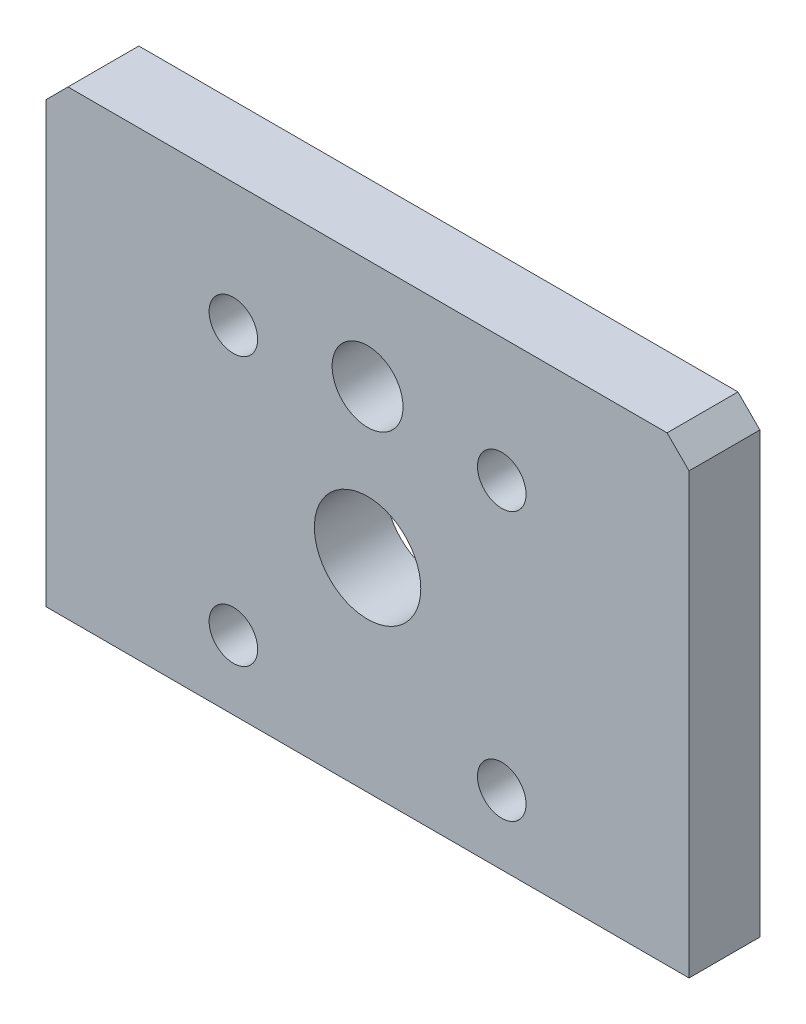
ISO-10303-21;
HEADER;
FILE_DESCRIPTION(('STEP AP214'),'2;1');
FILE_NAME('part.step','',(''),(''),'','','');
FILE_SCHEMA(('AUTOMOTIVE_DESIGN { 1 0 10303 214 1 1 1 1 }'));
ENDSEC;
DATA;
#1=APPLICATION_CONTEXT('core data for automotive mechanical design processes');
#2=APPLICATION_PROTOCOL_DEFINITION('international standard','automotive_design',2000,#1);
#3=PRODUCT_CONTEXT('',#1,'mechanical');
#4=PRODUCT('Part','Part','',(#3));
#5=PRODUCT_RELATED_PRODUCT_CATEGORY('part','',(#4));
#6=PRODUCT_DEFINITION_FORMATION('','',#4);
#7=PRODUCT_DEFINITION_CONTEXT('part definition',#1,'design');
#8=PRODUCT_DEFINITION('design','',#6,#7);
#9=PRODUCT_DEFINITION_SHAPE('','',#8);
#10=(LENGTH_UNIT() NAMED_UNIT(*) SI_UNIT(.MILLI.,.METRE.));
#11=(NAMED_UNIT(*) PLANE_ANGLE_UNIT() SI_UNIT($,.RADIAN.));
#12=(NAMED_UNIT(*) SI_UNIT($,.STERADIAN.) SOLID_ANGLE_UNIT());
#13=UNCERTAINTY_MEASURE_WITH_UNIT(LENGTH_MEASURE(1.E-05),#10,'distance_accuracy_value','');
#14=(GEOMETRIC_REPRESENTATION_CONTEXT(3) GLOBAL_UNCERTAINTY_ASSIGNED_CONTEXT((#13)) GLOBAL_UNIT_ASSIGNED_CONTEXT((#10,
#11,#12)) REPRESENTATION_CONTEXT('',''));
#15=CARTESIAN_POINT('',(0.,0.,0.));
#16=DIRECTION('',(0.,0.,1.));
#17=DIRECTION('',(1.,0.,0.));
#18=AXIS2_PLACEMENT_3D('',#15,#16,#17);
#19=CARTESIAN_POINT('',(30.2260023359817,18.0340010436572,1.016));
#20=DIRECTION('',(0.,0.,1.));
#21=DIRECTION('',(1.,0.,0.));
#22=AXIS2_PLACEMENT_3D('',#19,#20,#21);
#23=PLANE('',#22);
#24=CARTESIAN_POINT('',(30.2260023359817,18.0340010436572,1.016));
#25=DIRECTION('',(0.,0.,1.));
#26=DIRECTION('',(1.,0.,0.));
#27=AXIS2_PLACEMENT_3D('',#24,#25,#26);
#28=CIRCLE('',#27,7.1501);
#29=CARTESIAN_POINT('',(37.3761023359817,18.0340010436572,1.016));
#30=VERTEX_POINT('',#29);
#31=EDGE_CURVE('E19',#30,#30,#28,.F.);
#32=ORIENTED_EDGE('',*,*,#31,.T.);
#33=EDGE_LOOP('',(#32));
#34=FACE_BOUND('',#33,.T.);
#35=ADVANCED_FACE('F16',(#34),#23,.F.);
#36=CARTESIAN_POINT('',(30.2260023359815,-18.0340010436569,1.016));
#37=DIRECTION('',(0.,0.,1.));
#38=DIRECTION('',(1.,0.,0.));
#39=AXIS2_PLACEMENT_3D('',#36,#37,#38);
#40=PLANE('',#39);
#41=CARTESIAN_POINT('',(30.2260023359815,-18.0340010436569,1.016));
#42=DIRECTION('',(0.,0.,1.));
#43=DIRECTION('',(1.,0.,0.));
#44=AXIS2_PLACEMENT_3D('',#41,#42,#43);
#45=CIRCLE('',#44,7.1501);
#46=CARTESIAN_POINT('',(37.3761023359815,-18.0340010436569,1.016));
#47=VERTEX_POINT('',#46);
#48=EDGE_CURVE('E146',#47,#47,#45,.F.);
#49=ORIENTED_EDGE('',*,*,#48,.T.);
#50=EDGE_LOOP('',(#49));
#51=FACE_BOUND('',#50,.T.);
#52=ADVANCED_FACE('F238',(#51),#40,.F.);
#53=CARTESIAN_POINT('',(-30.2260023359812,18.0340010436578,1.016));
#54=DIRECTION('',(0.,0.,1.));
#55=DIRECTION('',(1.,0.,0.));
#56=AXIS2_PLACEMENT_3D('',#53,#54,#55);
#57=PLANE('',#56);
#58=CARTESIAN_POINT('',(-30.2260023359812,18.0340010436578,1.016));
#59=DIRECTION('',(0.,0.,1.));
#60=DIRECTION('',(1.,0.,0.));
#61=AXIS2_PLACEMENT_3D('',#58,#59,#60);
#62=CIRCLE('',#61,7.1501);
#63=CARTESIAN_POINT('',(-23.0759023359812,18.0340010436578,1.016));
#64=VERTEX_POINT('',#63);
#65=EDGE_CURVE('E144',#64,#64,#62,.F.);
#66=ORIENTED_EDGE('',*,*,#65,.T.);
#67=EDGE_LOOP('',(#66));
#68=FACE_BOUND('',#67,.T.);
#69=ADVANCED_FACE('F168',(#68),#57,.F.);
#70=CARTESIAN_POINT('',(-30.2260023359813,-18.0340010436572,1.016));
#71=DIRECTION('',(0.,0.,1.));
#72=DIRECTION('',(1.,0.,0.));
#73=AXIS2_PLACEMENT_3D('',#70,#71,#72);
#74=PLANE('',#73);
#75=CARTESIAN_POINT('',(-30.2260023359813,-18.0340010436572,1.016));
#76=DIRECTION('',(0.,0.,1.));
#77=DIRECTION('',(1.,0.,0.));
#78=AXIS2_PLACEMENT_3D('',#75,#76,#77);
#79=CIRCLE('',#78,7.1501);
#80=CARTESIAN_POINT('',(-23.0759023359813,-18.0340010436572,1.016));
#81=VERTEX_POINT('',#80);
#82=EDGE_CURVE('E141',#81,#81,#79,.F.);
#83=ORIENTED_EDGE('',*,*,#82,.T.);
#84=EDGE_LOOP('',(#83));
#85=FACE_BOUND('',#84,.T.);
#86=ADVANCED_FACE('F157',(#85),#74,.F.);
#87=CARTESIAN_POINT('',(30.2260023359817,18.0340010436572,0.));
#88=DIRECTION('',(0.,0.,1.));
#89=DIRECTION('',(1.,0.,0.));
#90=AXIS2_PLACEMENT_3D('',#87,#88,#89);
#91=CYLINDRICAL_SURFACE('',#90,7.1501);
#92=CARTESIAN_POINT('',(30.2260023359817,18.0340010436572,0.));
#93=DIRECTION('',(0.,0.,1.));
#94=DIRECTION('',(1.,0.,0.));
#95=AXIS2_PLACEMENT_3D('',#92,#93,#94);
#96=CIRCLE('',#95,7.1501);
#97=CARTESIAN_POINT('',(37.3761023359817,18.0340010436572,0.));
#98=VERTEX_POINT('',#97);
#99=EDGE_CURVE('E138',#98,#98,#96,.F.);
#100=ORIENTED_EDGE('',*,*,#99,.T.);
#101=EDGE_LOOP('',(#100));
#102=FACE_BOUND('',#101,.T.);
#103=ORIENTED_EDGE('',*,*,#31,.F.);
#104=EDGE_LOOP('',(#103));
#105=FACE_BOUND('',#104,.T.);
#106=ADVANCED_FACE('F154',(#102,#105),#91,.F.);
#107=CARTESIAN_POINT('',(30.2260023359815,-18.0340010436569,0.));
#108=DIRECTION('',(0.,0.,1.));
#109=DIRECTION('',(1.,0.,0.));
#110=AXIS2_PLACEMENT_3D('',#107,#108,#109);
#111=CYLINDRICAL_SURFACE('',#110,7.1501);
#112=CARTESIAN_POINT('',(30.2260023359815,-18.0340010436569,0.));
#113=DIRECTION('',(0.,0.,1.));
#114=DIRECTION('',(1.,0.,0.));
#115=AXIS2_PLACEMENT_3D('',#112,#113,#114);
#116=CIRCLE('',#115,7.1501);
#117=CARTESIAN_POINT('',(37.3761023359815,-18.0340010436569,0.));
#118=VERTEX_POINT('',#117);
#119=EDGE_CURVE('E135',#118,#118,#116,.F.);
#120=ORIENTED_EDGE('',*,*,#119,.T.);
#121=EDGE_LOOP('',(#120));
#122=FACE_BOUND('',#121,.T.);
#123=ORIENTED_EDGE('',*,*,#48,.F.);
#124=EDGE_LOOP('',(#123));
#125=FACE_BOUND('',#124,.T.);
#126=ADVANCED_FACE('F156',(#122,#125),#111,.F.);
#127=CARTESIAN_POINT('',(-30.2260023359812,18.0340010436578,0.));
#128=DIRECTION('',(0.,0.,1.));
#129=DIRECTION('',(1.,0.,0.));
#130=AXIS2_PLACEMENT_3D('',#127,#128,#129);
#131=CYLINDRICAL_SURFACE('',#130,7.1501);
#132=CARTESIAN_POINT('',(-30.2260023359812,18.0340010436578,0.));
#133=DIRECTION('',(0.,0.,1.));
#134=DIRECTION('',(1.,0.,0.));
#135=AXIS2_PLACEMENT_3D('',#132,#133,#134);
#136=CIRCLE('',#135,7.1501);
#137=CARTESIAN_POINT('',(-23.0759023359812,18.0340010436578,0.));
#138=VERTEX_POINT('',#137);
#139=EDGE_CURVE('E132',#138,#138,#136,.F.);
#140=ORIENTED_EDGE('',*,*,#139,.T.);
#141=EDGE_LOOP('',(#140));
#142=FACE_BOUND('',#141,.T.);
#143=ORIENTED_EDGE('',*,*,#65,.F.);
#144=EDGE_LOOP('',(#143));
#145=FACE_BOUND('',#144,.T.);
#146=ADVANCED_FACE('F165',(#142,#145),#131,.F.);
#147=CARTESIAN_POINT('',(-30.2260023359813,-18.0340010436572,0.));
#148=DIRECTION('',(0.,0.,1.));
#149=DIRECTION('',(1.,0.,0.));
#150=AXIS2_PLACEMENT_3D('',#147,#148,#149);
#151=CYLINDRICAL_SURFACE('',#150,7.1501);
#152=CARTESIAN_POINT('',(-30.2260023359813,-18.0340010436572,0.));
#153=DIRECTION('',(0.,0.,1.));
#154=DIRECTION('',(1.,0.,0.));
#155=AXIS2_PLACEMENT_3D('',#152,#153,#154);
#156=CIRCLE('',#155,7.1501);
#157=CARTESIAN_POINT('',(-23.0759023359813,-18.0340010436572,0.));
#158=VERTEX_POINT('',#157);
#159=EDGE_CURVE('E129',#158,#158,#156,.F.);
#160=ORIENTED_EDGE('',*,*,#159,.T.);
#161=EDGE_LOOP('',(#160));
#162=FACE_BOUND('',#161,.T.);
#163=ORIENTED_EDGE('',*,*,#82,.F.);
#164=EDGE_LOOP('',(#163));
#165=FACE_BOUND('',#164,.T.);
#166=ADVANCED_FACE('F224',(#162,#165),#151,.F.);
#167=CARTESIAN_POINT('',(-0.000517960062179773,3.30753162764427,0.));
#168=DIRECTION('',(0.,0.,1.));
#169=DIRECTION('',(1.,0.,0.));
#170=AXIS2_PLACEMENT_3D('',#167,#168,#169);
#171=PLANE('',#170);
#172=CARTESIAN_POINT('',(-18.034,18.034,0.));
#173=DIRECTION('',(0.,0.,1.));
#174=DIRECTION('',(1.,0.,0.));
#175=AXIS2_PLACEMENT_3D('',#172,#173,#174);
#176=CIRCLE('',#175,3.2639);
#177=CARTESIAN_POINT('',(-14.7701,18.034,0.));
#178=VERTEX_POINT('',#177);
#179=EDGE_CURVE('E112',#178,#178,#176,.T.);
#180=ORIENTED_EDGE('',*,*,#179,.T.);
#181=EDGE_LOOP('',(#180));
#182=FACE_BOUND('',#181,.T.);
#183=CARTESIAN_POINT('',(18.034,18.034,0.));
#184=DIRECTION('',(0.,0.,1.));
#185=DIRECTION('',(1.,0.,0.));
#186=AXIS2_PLACEMENT_3D('',#183,#184,#185);
#187=CIRCLE('',#186,3.2639);
#188=CARTESIAN_POINT('',(21.2979,18.034,0.));
#189=VERTEX_POINT('',#188);
#190=EDGE_CURVE('E115',#189,#189,#187,.T.);
#191=ORIENTED_EDGE('',*,*,#190,.T.);
#192=EDGE_LOOP('',(#191));
#193=FACE_BOUND('',#192,.T.);
#194=CARTESIAN_POINT('',(-18.034,-18.034,0.));
#195=DIRECTION('',(0.,0.,1.));
#196=DIRECTION('',(1.,0.,0.));
#197=AXIS2_PLACEMENT_3D('',#194,#195,#196);
#198=CIRCLE('',#197,3.2639);
#199=CARTESIAN_POINT('',(-14.7701,-18.034,0.));
#200=VERTEX_POINT('',#199);
#201=EDGE_CURVE('E118',#200,#200,#198,.T.);
#202=ORIENTED_EDGE('',*,*,#201,.T.);
#203=EDGE_LOOP('',(#202));
#204=FACE_BOUND('',#203,.T.);
#205=CARTESIAN_POINT('',(18.0340003967285,-18.0340003967285,0.));
#206=DIRECTION('',(0.,0.,1.));
#207=DIRECTION('',(1.,0.,0.));
#208=AXIS2_PLACEMENT_3D('',#205,#206,#207);
#209=CIRCLE('',#208,3.2639);
#210=CARTESIAN_POINT('',(21.2979003967285,-18.0340003967285,0.));
#211=VERTEX_POINT('',#210);
#212=EDGE_CURVE('E121',#211,#211,#209,.T.);
#213=ORIENTED_EDGE('',*,*,#212,.T.);
#214=EDGE_LOOP('',(#213));
#215=FACE_BOUND('',#214,.T.);
#216=CARTESIAN_POINT('',(0.,0.,0.));
#217=DIRECTION('',(0.,0.,1.));
#218=DIRECTION('',(1.,0.,0.));
#219=AXIS2_PLACEMENT_3D('',#216,#217,#218);
#220=CIRCLE('',#219,7.1501);
#221=CARTESIAN_POINT('',(7.1501,0.,0.));
#222=VERTEX_POINT('',#221);
#223=EDGE_CURVE('E126',#222,#222,#220,.T.);
#224=ORIENTED_EDGE('',*,*,#223,.T.);
#225=EDGE_LOOP('',(#224));
#226=FACE_BOUND('',#225,.T.);
#227=CARTESIAN_POINT('',(0.,19.939,0.));
#228=DIRECTION('',(0.,0.,1.));
#229=DIRECTION('',(1.,0.,0.));
#230=AXIS2_PLACEMENT_3D('',#227,#228,#229);
#231=CIRCLE('',#230,4.7625);
#232=CARTESIAN_POINT('',(4.7625,19.939,0.));
#233=VERTEX_POINT('',#232);
#234=EDGE_CURVE('E80',#233,#233,#231,.T.);
#235=ORIENTED_EDGE('',*,*,#234,.T.);
#236=EDGE_LOOP('',(#235));
#237=FACE_BOUND('',#236,.T.);
#238=DIRECTION('',(-0.707106781186571,0.707106781186524,0.));
#239=VECTOR('',#238,1.);
#240=CARTESIAN_POINT('',(40.2530953111135,34.6728457428421,0.));
#241=LINE('',#240,#239);
#242=CARTESIAN_POINT('',(43.2054,31.7205410539558,0.));
#243=VERTEX_POINT('',#242);
#244=CARTESIAN_POINT('',(40.2530953111135,34.6728457428421,0.));
#245=VERTEX_POINT('',#244);
#246=EDGE_CURVE('E71',#243,#245,#241,.T.);
#247=ORIENTED_EDGE('',*,*,#246,.F.);
#248=DIRECTION('',(0.,1.,0.));
#249=VECTOR('',#248,1.);
#250=CARTESIAN_POINT('',(43.2054,31.7205410539558,0.));
#251=LINE('',#250,#249);
#252=CARTESIAN_POINT('',(43.2054,-27.303154257158,0.));
#253=VERTEX_POINT('',#252);
#254=EDGE_CURVE('E422',#253,#243,#251,.T.);
#255=ORIENTED_EDGE('',*,*,#254,.F.);
#256=DIRECTION('',(1.,0.,0.));
#257=VECTOR('',#256,1.);
#258=CARTESIAN_POINT('',(43.2054,-27.303154257158,0.));
#259=LINE('',#258,#257);
#260=CARTESIAN_POINT('',(-43.2054,-27.303154257158,0.));
#261=VERTEX_POINT('',#260);
#262=EDGE_CURVE('E425',#261,#253,#259,.T.);
#263=ORIENTED_EDGE('',*,*,#262,.F.);
#264=DIRECTION('',(0.,1.,0.));
#265=VECTOR('',#264,1.);
#266=CARTESIAN_POINT('',(-43.2054,-27.303154257158,0.));
#267=LINE('',#266,#265);
#268=CARTESIAN_POINT('',(-43.2054,31.7205410539552,0.));
#269=VERTEX_POINT('',#268);
#270=EDGE_CURVE('E429',#269,#261,#267,.F.);
#271=ORIENTED_EDGE('',*,*,#270,.F.);
#272=DIRECTION('',(-0.705688297333378,-0.708522425196774,0.));
#273=VECTOR('',#272,1.);
#274=CARTESIAN_POINT('',(-43.2054,31.7205410539552,0.));
#275=LINE('',#274,#273);
#276=CARTESIAN_POINT('',(-40.2649046888864,34.6728457428421,0.));
#277=VERTEX_POINT('',#276);
#278=EDGE_CURVE('E85',#277,#269,#275,.T.);
#279=ORIENTED_EDGE('',*,*,#278,.F.);
#280=DIRECTION('',(1.,0.,0.));
#281=VECTOR('',#280,1.);
#282=CARTESIAN_POINT('',(-40.2649046888864,34.6728457428421,0.));
#283=LINE('',#282,#281);
#284=EDGE_CURVE('E66',#245,#277,#283,.F.);
#285=ORIENTED_EDGE('',*,*,#284,.F.);
#286=EDGE_LOOP('',(#247,#255,#263,#271,#279,#285));
#287=FACE_BOUND('',#286,.T.);
#288=ORIENTED_EDGE('',*,*,#159,.F.);
#289=EDGE_LOOP('',(#288));
#290=FACE_BOUND('',#289,.T.);
#291=ORIENTED_EDGE('',*,*,#139,.F.);
#292=EDGE_LOOP('',(#291));
#293=FACE_BOUND('',#292,.T.);
#294=ORIENTED_EDGE('',*,*,#119,.F.);
#295=EDGE_LOOP('',(#294));
#296=FACE_BOUND('',#295,.T.);
#297=ORIENTED_EDGE('',*,*,#99,.F.);
#298=EDGE_LOOP('',(#297));
#299=FACE_BOUND('',#298,.T.);
#300=ADVANCED_FACE('F82',(#182,#193,#204,#215,#226,#237,#287,#290,#293,#296,#299),#171,.F.);
#301=CARTESIAN_POINT('',(0.,0.,-106.764116432629));
#302=DIRECTION('',(0.,0.,1.));
#303=DIRECTION('',(1.,0.,0.));
#304=AXIS2_PLACEMENT_3D('',#301,#302,#303);
#305=CYLINDRICAL_SURFACE('',#304,7.1501);
#306=CARTESIAN_POINT('',(0.,0.,9.52500000000001));
#307=DIRECTION('',(0.,0.,1.));
#308=DIRECTION('',(1.,0.,0.));
#309=AXIS2_PLACEMENT_3D('',#306,#307,#308);
#310=CIRCLE('',#309,7.1501);
#311=CARTESIAN_POINT('',(7.1501,0.,9.52500000000001));
#312=VERTEX_POINT('',#311);
#313=EDGE_CURVE('E109',#312,#312,#310,.F.);
#314=ORIENTED_EDGE('',*,*,#313,.F.);
#315=EDGE_LOOP('',(#314));
#316=FACE_BOUND('',#315,.T.);
#317=ORIENTED_EDGE('',*,*,#223,.F.);
#318=EDGE_LOOP('',(#317));
#319=FACE_BOUND('',#318,.T.);
#320=ADVANCED_FACE('F217',(#316,#319),#305,.F.);
#321=CARTESIAN_POINT('',(0.,19.939,-106.764116432629));
#322=DIRECTION('',(0.,0.,1.));
#323=DIRECTION('',(1.,0.,0.));
#324=AXIS2_PLACEMENT_3D('',#321,#322,#323);
#325=CYLINDRICAL_SURFACE('',#324,4.7625);
#326=CARTESIAN_POINT('',(0.,19.939,9.52500000000001));
#327=DIRECTION('',(0.,0.,1.));
#328=DIRECTION('',(1.,0.,0.));
#329=AXIS2_PLACEMENT_3D('',#326,#327,#328);
#330=CIRCLE('',#329,4.7625);
#331=CARTESIAN_POINT('',(4.7625,19.939,9.52500000000001));
#332=VERTEX_POINT('',#331);
#333=EDGE_CURVE('E105',#332,#332,#330,.F.);
#334=ORIENTED_EDGE('',*,*,#333,.F.);
#335=EDGE_LOOP('',(#334));
#336=FACE_BOUND('',#335,.T.);
#337=ORIENTED_EDGE('',*,*,#234,.F.);
#338=EDGE_LOOP('',(#337));
#339=FACE_BOUND('',#338,.T.);
#340=ADVANCED_FACE('F214',(#336,#339),#325,.F.);
#341=CARTESIAN_POINT('',(40.2530953111135,34.6728457428421,0.));
#342=DIRECTION('',(0.707106781186524,0.707106781186571,0.));
#343=DIRECTION('',(-0.707106781186571,0.707106781186524,0.));
#344=AXIS2_PLACEMENT_3D('',#341,#342,#343);
#345=PLANE('',#344);
#346=ORIENTED_EDGE('',*,*,#246,.T.);
#347=DIRECTION('',(0.,0.,1.));
#348=VECTOR('',#347,1.);
#349=CARTESIAN_POINT('',(40.2530953111135,34.6728457428421,0.));
#350=LINE('',#349,#348);
#351=CARTESIAN_POINT('',(40.2530953111135,34.6728457428421,9.525));
#352=VERTEX_POINT('',#351);
#353=EDGE_CURVE('E73',#352,#245,#350,.F.);
#354=ORIENTED_EDGE('',*,*,#353,.F.);
#355=DIRECTION('',(-0.707106781186572,0.707106781186523,0.));
#356=VECTOR('',#355,1.);
#357=CARTESIAN_POINT('',(43.2054,31.7205410539558,9.525));
#358=LINE('',#357,#356);
#359=CARTESIAN_POINT('',(43.2054,31.7205410539558,9.525));
#360=VERTEX_POINT('',#359);
#361=EDGE_CURVE('E108',#360,#352,#358,.T.);
#362=ORIENTED_EDGE('',*,*,#361,.F.);
#363=DIRECTION('',(0.,0.,-1.));
#364=VECTOR('',#363,1.);
#365=CARTESIAN_POINT('',(43.2054,31.7205410539558,0.));
#366=LINE('',#365,#364);
#367=EDGE_CURVE('E76',#243,#360,#366,.F.);
#368=ORIENTED_EDGE('',*,*,#367,.F.);
#369=EDGE_LOOP('',(#346,#354,#362,#368));
#370=FACE_BOUND('',#369,.T.);
#371=ADVANCED_FACE('F72',(#370),#345,.T.);
#372=CARTESIAN_POINT('',(-40.2649046888864,34.6728457428421,0.));
#373=DIRECTION('',(0.,1.,0.));
#374=DIRECTION('',(0.,0.,1.));
#375=AXIS2_PLACEMENT_3D('',#372,#373,#374);
#376=PLANE('',#375);
#377=ORIENTED_EDGE('',*,*,#284,.T.);
#378=DIRECTION('',(0.,0.,1.));
#379=VECTOR('',#378,1.);
#380=CARTESIAN_POINT('',(-40.2649046888864,34.6728457428421,0.));
#381=LINE('',#380,#379);
#382=CARTESIAN_POINT('',(-40.2649046888864,34.6728457428421,9.525));
#383=VERTEX_POINT('',#382);
#384=EDGE_CURVE('E87',#383,#277,#381,.F.);
#385=ORIENTED_EDGE('',*,*,#384,.F.);
#386=DIRECTION('',(1.,0.,0.));
#387=VECTOR('',#386,1.);
#388=CARTESIAN_POINT('',(-0.000517960062179773,34.6728457428421,9.525));
#389=LINE('',#388,#387);
#390=EDGE_CURVE('E91',#352,#383,#389,.F.);
#391=ORIENTED_EDGE('',*,*,#390,.F.);
#392=ORIENTED_EDGE('',*,*,#353,.T.);
#393=EDGE_LOOP('',(#377,#385,#391,#392));
#394=FACE_BOUND('',#393,.T.);
#395=ADVANCED_FACE('F89',(#394),#376,.T.);
#396=CARTESIAN_POINT('',(-43.2054,31.7205410539552,0.));
#397=DIRECTION('',(-0.708522425196774,0.705688297333378,0.));
#398=DIRECTION('',(-0.705688297333378,-0.708522425196774,0.));
#399=AXIS2_PLACEMENT_3D('',#396,#397,#398);
#400=PLANE('',#399);
#401=ORIENTED_EDGE('',*,*,#278,.T.);
#402=DIRECTION('',(0.,0.,1.));
#403=VECTOR('',#402,1.);
#404=CARTESIAN_POINT('',(-43.2054,31.7205410539552,0.));
#405=LINE('',#404,#403);
#406=CARTESIAN_POINT('',(-43.2054,31.7205410539552,9.525));
#407=VERTEX_POINT('',#406);
#408=EDGE_CURVE('E431',#407,#269,#405,.F.);
#409=ORIENTED_EDGE('',*,*,#408,.F.);
#410=DIRECTION('',(-0.70568829733338,-0.708522425196772,0.));
#411=VECTOR('',#410,1.);
#412=CARTESIAN_POINT('',(-40.2649046888864,34.6728457428421,9.525));
#413=LINE('',#412,#411);
#414=EDGE_CURVE('E415',#383,#407,#413,.T.);
#415=ORIENTED_EDGE('',*,*,#414,.F.);
#416=ORIENTED_EDGE('',*,*,#384,.T.);
#417=EDGE_LOOP('',(#401,#409,#415,#416));
#418=FACE_BOUND('',#417,.T.);
#419=ADVANCED_FACE('F205',(#418),#400,.T.);
#420=CARTESIAN_POINT('',(-43.2054,-27.303154257158,0.));
#421=DIRECTION('',(-1.,0.,0.));
#422=DIRECTION('',(0.,0.,1.));
#423=AXIS2_PLACEMENT_3D('',#420,#421,#422);
#424=PLANE('',#423);
#425=ORIENTED_EDGE('',*,*,#270,.T.);
#426=DIRECTION('',(0.,0.,1.));
#427=VECTOR('',#426,1.);
#428=CARTESIAN_POINT('',(-43.2054,-27.303154257158,0.));
#429=LINE('',#428,#427);
#430=CARTESIAN_POINT('',(-43.2054,-27.303154257158,9.525));
#431=VERTEX_POINT('',#430);
#432=EDGE_CURVE('E427',#431,#261,#429,.F.);
#433=ORIENTED_EDGE('',*,*,#432,.F.);
#434=DIRECTION('',(0.,1.,0.));
#435=VECTOR('',#434,1.);
#436=CARTESIAN_POINT('',(-43.2054,3.30753162764427,9.525));
#437=LINE('',#436,#435);
#438=EDGE_CURVE('E411',#407,#431,#437,.F.);
#439=ORIENTED_EDGE('',*,*,#438,.F.);
#440=ORIENTED_EDGE('',*,*,#408,.T.);
#441=EDGE_LOOP('',(#425,#433,#439,#440));
#442=FACE_BOUND('',#441,.T.);
#443=ADVANCED_FACE('F202',(#442),#424,.T.);
#444=CARTESIAN_POINT('',(43.2054,-27.303154257158,0.));
#445=DIRECTION('',(0.,-1.,0.));
#446=DIRECTION('',(1.,0.,0.));
#447=AXIS2_PLACEMENT_3D('',#444,#445,#446);
#448=PLANE('',#447);
#449=ORIENTED_EDGE('',*,*,#262,.T.);
#450=DIRECTION('',(0.,0.,-1.));
#451=VECTOR('',#450,1.);
#452=CARTESIAN_POINT('',(43.2054,-27.303154257158,0.));
#453=LINE('',#452,#451);
#454=CARTESIAN_POINT('',(43.2054,-27.303154257158,9.525));
#455=VERTEX_POINT('',#454);
#456=EDGE_CURVE('E34',#455,#253,#453,.T.);
#457=ORIENTED_EDGE('',*,*,#456,.F.);
#458=DIRECTION('',(1.,0.,0.));
#459=VECTOR('',#458,1.);
#460=CARTESIAN_POINT('',(-0.000517960062179773,-27.303154257158,9.525));
#461=LINE('',#460,#459);
#462=EDGE_CURVE('E405',#431,#455,#461,.T.);
#463=ORIENTED_EDGE('',*,*,#462,.F.);
#464=ORIENTED_EDGE('',*,*,#432,.T.);
#465=EDGE_LOOP('',(#449,#457,#463,#464));
#466=FACE_BOUND('',#465,.T.);
#467=ADVANCED_FACE('F198',(#466),#448,.T.);
#468=CARTESIAN_POINT('',(43.2054,31.7205410539558,0.));
#469=DIRECTION('',(1.,0.,0.));
#470=DIRECTION('',(0.,0.,-1.));
#471=AXIS2_PLACEMENT_3D('',#468,#469,#470);
#472=PLANE('',#471);
#473=ORIENTED_EDGE('',*,*,#254,.T.);
#474=ORIENTED_EDGE('',*,*,#367,.T.);
#475=DIRECTION('',(0.,1.,0.));
#476=VECTOR('',#475,1.);
#477=CARTESIAN_POINT('',(43.2054,3.30753162764427,9.525));
#478=LINE('',#477,#476);
#479=EDGE_CURVE('E104',#455,#360,#478,.T.);
#480=ORIENTED_EDGE('',*,*,#479,.F.);
#481=ORIENTED_EDGE('',*,*,#456,.T.);
#482=EDGE_LOOP('',(#473,#474,#480,#481));
#483=FACE_BOUND('',#482,.T.);
#484=ADVANCED_FACE('F194',(#483),#472,.T.);
#485=CARTESIAN_POINT('',(18.0340003967285,-18.0340003967285,-106.764116432629));
#486=DIRECTION('',(0.,0.,1.));
#487=DIRECTION('',(1.,0.,0.));
#488=AXIS2_PLACEMENT_3D('',#485,#486,#487);
#489=CYLINDRICAL_SURFACE('',#488,3.2639);
#490=ORIENTED_EDGE('',*,*,#212,.F.);
#491=EDGE_LOOP('',(#490));
#492=FACE_BOUND('',#491,.T.);
#493=CARTESIAN_POINT('',(18.0340003967285,-18.0340003967285,9.52500000000001));
#494=DIRECTION('',(0.,0.,1.));
#495=DIRECTION('',(1.,0.,0.));
#496=AXIS2_PLACEMENT_3D('',#493,#494,#495);
#497=CIRCLE('',#496,3.2639);
#498=CARTESIAN_POINT('',(21.2979003967285,-18.0340003967285,9.52500000000001));
#499=VERTEX_POINT('',#498);
#500=EDGE_CURVE('E101',#499,#499,#497,.F.);
#501=ORIENTED_EDGE('',*,*,#500,.F.);
#502=EDGE_LOOP('',(#501));
#503=FACE_BOUND('',#502,.T.);
#504=ADVANCED_FACE('F190',(#492,#503),#489,.F.);
#505=CARTESIAN_POINT('',(-18.034,-18.034,-106.764116432629));
#506=DIRECTION('',(0.,0.,1.));
#507=DIRECTION('',(1.,0.,0.));
#508=AXIS2_PLACEMENT_3D('',#505,#506,#507);
#509=CYLINDRICAL_SURFACE('',#508,3.2639);
#510=ORIENTED_EDGE('',*,*,#201,.F.);
#511=EDGE_LOOP('',(#510));
#512=FACE_BOUND('',#511,.T.);
#513=CARTESIAN_POINT('',(-18.034,-18.034,9.52500000000001));
#514=DIRECTION('',(0.,0.,1.));
#515=DIRECTION('',(1.,0.,0.));
#516=AXIS2_PLACEMENT_3D('',#513,#514,#515);
#517=CIRCLE('',#516,3.2639);
#518=CARTESIAN_POINT('',(-14.7701,-18.034,9.52500000000001));
#519=VERTEX_POINT('',#518);
#520=EDGE_CURVE('E98',#519,#519,#517,.F.);
#521=ORIENTED_EDGE('',*,*,#520,.F.);
#522=EDGE_LOOP('',(#521));
#523=FACE_BOUND('',#522,.T.);
#524=ADVANCED_FACE('F186',(#512,#523),#509,.F.);
#525=CARTESIAN_POINT('',(18.034,18.034,-106.764116432629));
#526=DIRECTION('',(0.,0.,1.));
#527=DIRECTION('',(1.,0.,0.));
#528=AXIS2_PLACEMENT_3D('',#525,#526,#527);
#529=CYLINDRICAL_SURFACE('',#528,3.2639);
#530=ORIENTED_EDGE('',*,*,#190,.F.);
#531=EDGE_LOOP('',(#530));
#532=FACE_BOUND('',#531,.T.);
#533=CARTESIAN_POINT('',(18.034,18.034,9.52500000000001));
#534=DIRECTION('',(0.,0.,1.));
#535=DIRECTION('',(1.,0.,0.));
#536=AXIS2_PLACEMENT_3D('',#533,#534,#535);
#537=CIRCLE('',#536,3.2639);
#538=CARTESIAN_POINT('',(21.2979,18.034,9.52500000000001));
#539=VERTEX_POINT('',#538);
#540=EDGE_CURVE('E25',#539,#539,#537,.F.);
#541=ORIENTED_EDGE('',*,*,#540,.F.);
#542=EDGE_LOOP('',(#541));
#543=FACE_BOUND('',#542,.T.);
#544=ADVANCED_FACE('F179',(#532,#543),#529,.F.);
#545=CARTESIAN_POINT('',(-18.034,18.034,-106.764116432629));
#546=DIRECTION('',(0.,0.,1.));
#547=DIRECTION('',(1.,0.,0.));
#548=AXIS2_PLACEMENT_3D('',#545,#546,#547);
#549=CYLINDRICAL_SURFACE('',#548,3.2639);
#550=ORIENTED_EDGE('',*,*,#179,.F.);
#551=EDGE_LOOP('',(#550));
#552=FACE_BOUND('',#551,.T.);
#553=CARTESIAN_POINT('',(-18.034,18.034,9.52500000000001));
#554=DIRECTION('',(0.,0.,1.));
#555=DIRECTION('',(1.,0.,0.));
#556=AXIS2_PLACEMENT_3D('',#553,#554,#555);
#557=CIRCLE('',#556,3.2639);
#558=CARTESIAN_POINT('',(-14.7701,18.034,9.52500000000001));
#559=VERTEX_POINT('',#558);
#560=EDGE_CURVE('E11',#559,#559,#557,.F.);
#561=ORIENTED_EDGE('',*,*,#560,.F.);
#562=EDGE_LOOP('',(#561));
#563=FACE_BOUND('',#562,.T.);
#564=ADVANCED_FACE('F173',(#552,#563),#549,.F.);
#565=CARTESIAN_POINT('',(-0.000517960062179773,3.30753162764427,9.525));
#566=DIRECTION('',(0.,0.,1.));
#567=DIRECTION('',(1.,0.,0.));
#568=AXIS2_PLACEMENT_3D('',#565,#566,#567);
#569=PLANE('',#568);
#570=ORIENTED_EDGE('',*,*,#560,.T.);
#571=EDGE_LOOP('',(#570));
#572=FACE_BOUND('',#571,.T.);
#573=ORIENTED_EDGE('',*,*,#540,.T.);
#574=EDGE_LOOP('',(#573));
#575=FACE_BOUND('',#574,.T.);
#576=ORIENTED_EDGE('',*,*,#520,.T.);
#577=EDGE_LOOP('',(#576));
#578=FACE_BOUND('',#577,.T.);
#579=ORIENTED_EDGE('',*,*,#500,.T.);
#580=EDGE_LOOP('',(#579));
#581=FACE_BOUND('',#580,.T.);
#582=ORIENTED_EDGE('',*,*,#462,.T.);
#583=ORIENTED_EDGE('',*,*,#479,.T.);
#584=ORIENTED_EDGE('',*,*,#361,.T.);
#585=ORIENTED_EDGE('',*,*,#390,.T.);
#586=ORIENTED_EDGE('',*,*,#414,.T.);
#587=ORIENTED_EDGE('',*,*,#438,.T.);
#588=EDGE_LOOP('',(#582,#583,#584,#585,#586,#587));
#589=FACE_BOUND('',#588,.T.);
#590=ORIENTED_EDGE('',*,*,#333,.T.);
#591=EDGE_LOOP('',(#590));
#592=FACE_BOUND('',#591,.T.);
#593=ORIENTED_EDGE('',*,*,#313,.T.);
#594=EDGE_LOOP('',(#593));
#595=FACE_BOUND('',#594,.T.);
#596=ADVANCED_FACE('F171',(#572,#575,#578,#581,#589,#592,#595),#569,.T.);
#597=CLOSED_SHELL('',(#35,#52,#69,#86,#106,#126,#146,#166,#300,#320,#340,#371,#395,#419,#443,
#467,#484,#504,#524,#544,#564,#596));
#598=MANIFOLD_SOLID_BREP('B1',#597);
#599=ADVANCED_BREP_SHAPE_REPRESENTATION('',(#18,#598),#14);
#600=SHAPE_DEFINITION_REPRESENTATION(#9,#599);
ENDSEC;
END-ISO-10303-21;
